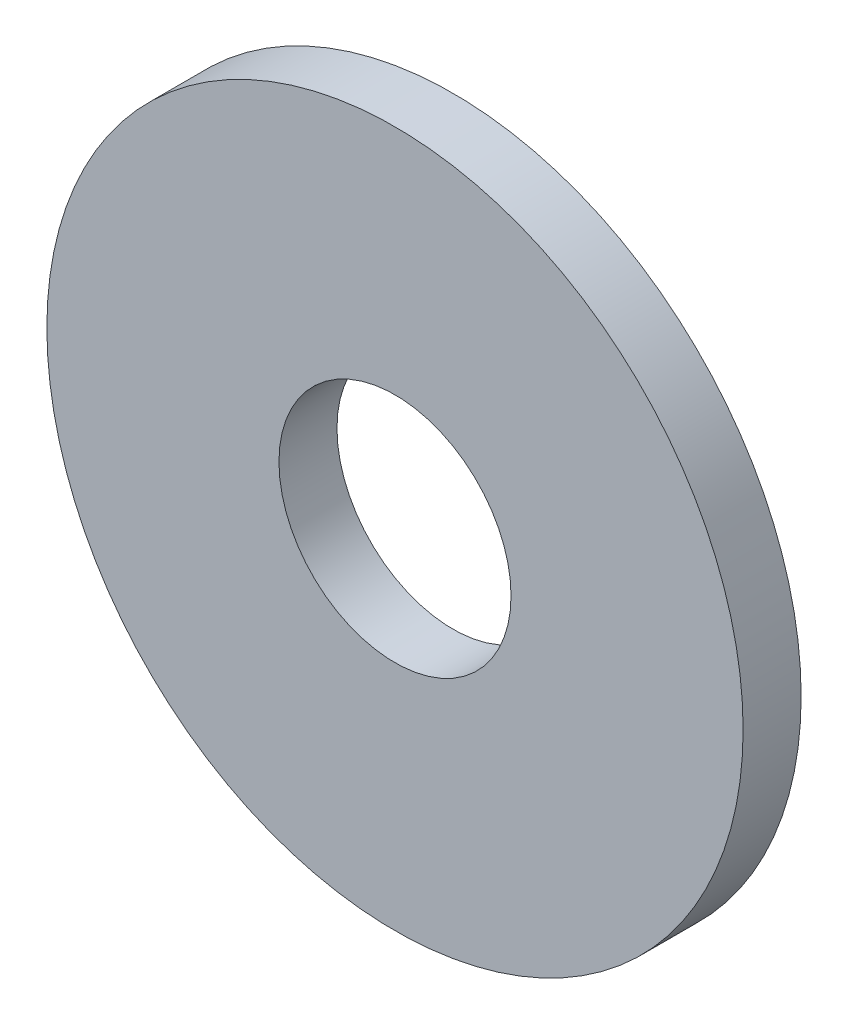
ISO-10303-21;
HEADER;
FILE_DESCRIPTION(('STEP AP214'),'2;1');
FILE_NAME('part.step','',(''),(''),'','','');
FILE_SCHEMA(('AUTOMOTIVE_DESIGN { 1 0 10303 214 1 1 1 1 }'));
ENDSEC;
DATA;
#1=APPLICATION_CONTEXT('core data for automotive mechanical design processes');
#2=APPLICATION_PROTOCOL_DEFINITION('international standard','automotive_design',2000,#1);
#3=PRODUCT_CONTEXT('',#1,'mechanical');
#4=PRODUCT('Part','Part','',(#3));
#5=PRODUCT_RELATED_PRODUCT_CATEGORY('part','',(#4));
#6=PRODUCT_DEFINITION_FORMATION('','',#4);
#7=PRODUCT_DEFINITION_CONTEXT('part definition',#1,'design');
#8=PRODUCT_DEFINITION('design','',#6,#7);
#9=PRODUCT_DEFINITION_SHAPE('','',#8);
#10=(LENGTH_UNIT() NAMED_UNIT(*) SI_UNIT(.MILLI.,.METRE.));
#11=(NAMED_UNIT(*) PLANE_ANGLE_UNIT() SI_UNIT($,.RADIAN.));
#12=(NAMED_UNIT(*) SI_UNIT($,.STERADIAN.) SOLID_ANGLE_UNIT());
#13=UNCERTAINTY_MEASURE_WITH_UNIT(LENGTH_MEASURE(1.E-05),#10,'distance_accuracy_value','');
#14=(GEOMETRIC_REPRESENTATION_CONTEXT(3) GLOBAL_UNCERTAINTY_ASSIGNED_CONTEXT((#13)) GLOBAL_UNIT_ASSIGNED_CONTEXT((#10,
#11,#12)) REPRESENTATION_CONTEXT('',''));
#15=CARTESIAN_POINT('',(0.,0.,0.));
#16=DIRECTION('',(0.,0.,1.));
#17=DIRECTION('',(1.,0.,0.));
#18=AXIS2_PLACEMENT_3D('',#15,#16,#17);
#19=CARTESIAN_POINT('',(0.,0.,1.));
#20=DIRECTION('',(0.,0.,1.));
#21=DIRECTION('',(1.,0.,0.));
#22=AXIS2_PLACEMENT_3D('',#19,#20,#21);
#23=PLANE('',#22);
#24=CARTESIAN_POINT('',(0.,0.,1.));
#25=DIRECTION('',(0.,0.,1.));
#26=DIRECTION('',(1.,0.,0.));
#27=AXIS2_PLACEMENT_3D('',#24,#25,#26);
#28=CIRCLE('',#27,6.);
#29=CARTESIAN_POINT('',(6.,0.,1.));
#30=VERTEX_POINT('',#29);
#31=EDGE_CURVE('E10',#30,#30,#28,.T.);
#32=ORIENTED_EDGE('',*,*,#31,.T.);
#33=EDGE_LOOP('',(#32));
#34=FACE_BOUND('',#33,.T.);
#35=CARTESIAN_POINT('',(0.,0.,1.));
#36=DIRECTION('',(0.,0.,1.));
#37=DIRECTION('',(1.,0.,0.));
#38=AXIS2_PLACEMENT_3D('',#35,#36,#37);
#39=CIRCLE('',#38,2.);
#40=CARTESIAN_POINT('',(2.,0.,1.));
#41=VERTEX_POINT('',#40);
#42=EDGE_CURVE('E44',#41,#41,#39,.T.);
#43=ORIENTED_EDGE('',*,*,#42,.F.);
#44=EDGE_LOOP('',(#43));
#45=FACE_BOUND('',#44,.T.);
#46=ADVANCED_FACE('F33',(#34,#45),#23,.T.);
#47=CARTESIAN_POINT('',(0.,0.,0.));
#48=DIRECTION('',(0.,0.,1.));
#49=DIRECTION('',(1.,0.,0.));
#50=AXIS2_PLACEMENT_3D('',#47,#48,#49);
#51=PLANE('',#50);
#52=CARTESIAN_POINT('',(0.,0.,0.));
#53=DIRECTION('',(0.,0.,1.));
#54=DIRECTION('',(1.,0.,0.));
#55=AXIS2_PLACEMENT_3D('',#52,#53,#54);
#56=CIRCLE('',#55,6.);
#57=CARTESIAN_POINT('',(6.,0.,0.));
#58=VERTEX_POINT('',#57);
#59=EDGE_CURVE('E37',#58,#58,#56,.T.);
#60=ORIENTED_EDGE('',*,*,#59,.F.);
#61=EDGE_LOOP('',(#60));
#62=FACE_BOUND('',#61,.T.);
#63=CARTESIAN_POINT('',(0.,0.,0.));
#64=DIRECTION('',(0.,0.,1.));
#65=DIRECTION('',(1.,0.,0.));
#66=AXIS2_PLACEMENT_3D('',#63,#64,#65);
#67=CIRCLE('',#66,2.);
#68=CARTESIAN_POINT('',(2.,0.,0.));
#69=VERTEX_POINT('',#68);
#70=EDGE_CURVE('E46',#69,#69,#67,.T.);
#71=ORIENTED_EDGE('',*,*,#70,.T.);
#72=EDGE_LOOP('',(#71));
#73=FACE_BOUND('',#72,.T.);
#74=ADVANCED_FACE('F56',(#62,#73),#51,.F.);
#75=CARTESIAN_POINT('',(0.,0.,1.));
#76=DIRECTION('',(0.,0.,-1.));
#77=DIRECTION('',(-1.,0.,0.));
#78=AXIS2_PLACEMENT_3D('',#75,#76,#77);
#79=CYLINDRICAL_SURFACE('',#78,6.);
#80=ORIENTED_EDGE('',*,*,#31,.F.);
#81=EDGE_LOOP('',(#80));
#82=FACE_BOUND('',#81,.T.);
#83=ORIENTED_EDGE('',*,*,#59,.T.);
#84=EDGE_LOOP('',(#83));
#85=FACE_BOUND('',#84,.T.);
#86=ADVANCED_FACE('F35',(#82,#85),#79,.T.);
#87=CARTESIAN_POINT('',(0.,0.,1.));
#88=DIRECTION('',(0.,0.,-1.));
#89=DIRECTION('',(-1.,0.,0.));
#90=AXIS2_PLACEMENT_3D('',#87,#88,#89);
#91=CYLINDRICAL_SURFACE('',#90,2.);
#92=ORIENTED_EDGE('',*,*,#42,.T.);
#93=EDGE_LOOP('',(#92));
#94=FACE_BOUND('',#93,.T.);
#95=ORIENTED_EDGE('',*,*,#70,.F.);
#96=EDGE_LOOP('',(#95));
#97=FACE_BOUND('',#96,.T.);
#98=ADVANCED_FACE('F52',(#94,#97),#91,.F.);
#99=CLOSED_SHELL('',(#46,#74,#86,#98));
#100=MANIFOLD_SOLID_BREP('B2',#99);
#101=ADVANCED_BREP_SHAPE_REPRESENTATION('',(#18,#100),#14);
#102=SHAPE_DEFINITION_REPRESENTATION(#9,#101);
ENDSEC;
END-ISO-10303-21;
